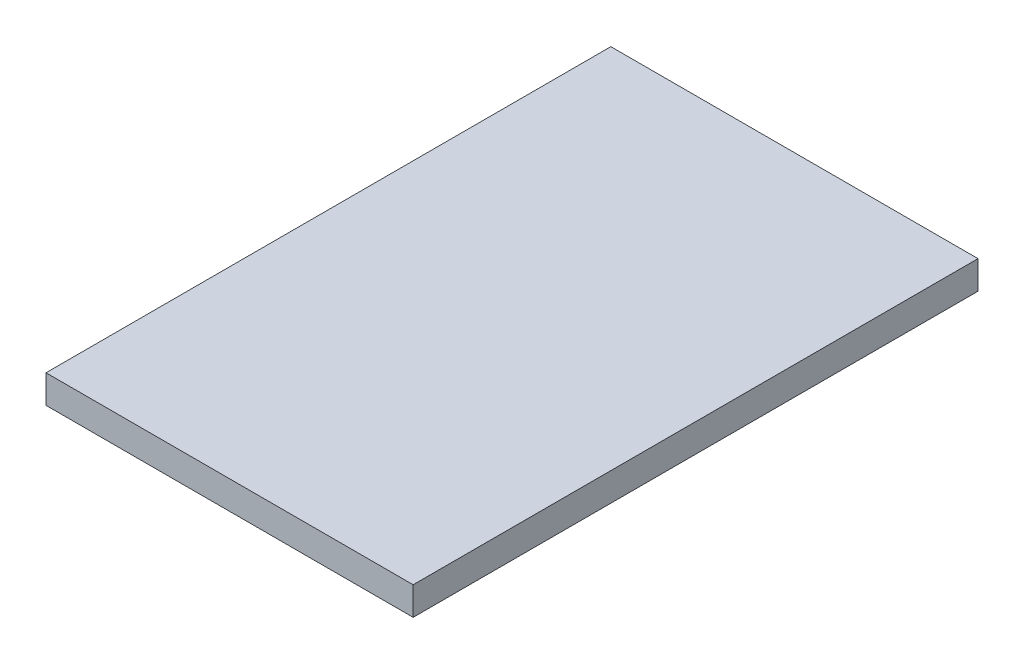
ISO-10303-21;
HEADER;
FILE_DESCRIPTION(('STEP AP214'),'2;1');
FILE_NAME('part.step','',(''),(''),'','','');
FILE_SCHEMA(('AUTOMOTIVE_DESIGN { 1 0 10303 214 1 1 1 1 }'));
ENDSEC;
DATA;
#1=APPLICATION_CONTEXT('core data for automotive mechanical design processes');
#2=APPLICATION_PROTOCOL_DEFINITION('international standard','automotive_design',2000,#1);
#3=PRODUCT_CONTEXT('',#1,'mechanical');
#4=PRODUCT('Part','Part','',(#3));
#5=PRODUCT_RELATED_PRODUCT_CATEGORY('part','',(#4));
#6=PRODUCT_DEFINITION_FORMATION('','',#4);
#7=PRODUCT_DEFINITION_CONTEXT('part definition',#1,'design');
#8=PRODUCT_DEFINITION('design','',#6,#7);
#9=PRODUCT_DEFINITION_SHAPE('','',#8);
#10=(LENGTH_UNIT() NAMED_UNIT(*) SI_UNIT(.MILLI.,.METRE.));
#11=(NAMED_UNIT(*) PLANE_ANGLE_UNIT() SI_UNIT($,.RADIAN.));
#12=(NAMED_UNIT(*) SI_UNIT($,.STERADIAN.) SOLID_ANGLE_UNIT());
#13=UNCERTAINTY_MEASURE_WITH_UNIT(LENGTH_MEASURE(1.E-05),#10,'distance_accuracy_value','');
#14=(GEOMETRIC_REPRESENTATION_CONTEXT(3) GLOBAL_UNCERTAINTY_ASSIGNED_CONTEXT((#13)) GLOBAL_UNIT_ASSIGNED_CONTEXT((#10,
#11,#12)) REPRESENTATION_CONTEXT('',''));
#15=CARTESIAN_POINT('',(0.,0.,0.));
#16=DIRECTION('',(0.,0.,1.));
#17=DIRECTION('',(1.,0.,0.));
#18=AXIS2_PLACEMENT_3D('',#15,#16,#17);
#19=CARTESIAN_POINT('',(-106.568983369222,25.4,-229.704347826087));
#20=DIRECTION('',(1.,0.,0.));
#21=DIRECTION('',(0.,0.,-1.));
#22=AXIS2_PLACEMENT_3D('',#19,#20,#21);
#23=PLANE('',#22);
#24=DIRECTION('',(0.,0.,1.));
#25=VECTOR('',#24,1.);
#26=CARTESIAN_POINT('',(-106.568983369222,0.,-229.704347826087));
#27=LINE('',#26,#25);
#28=CARTESIAN_POINT('',(-106.568983369222,0.,-229.704347826087));
#29=VERTEX_POINT('',#28);
#30=CARTESIAN_POINT('',(-106.568983369222,0.,278.295652173913));
#31=VERTEX_POINT('',#30);
#32=EDGE_CURVE('E102',#29,#31,#27,.T.);
#33=ORIENTED_EDGE('',*,*,#32,.T.);
#34=DIRECTION('',(0.,-1.,0.));
#35=VECTOR('',#34,1.);
#36=CARTESIAN_POINT('',(-106.568983369222,25.4,278.295652173913));
#37=LINE('',#36,#35);
#38=CARTESIAN_POINT('',(-106.568983369222,25.4,278.295652173913));
#39=VERTEX_POINT('',#38);
#40=EDGE_CURVE('E11',#39,#31,#37,.T.);
#41=ORIENTED_EDGE('',*,*,#40,.F.);
#42=DIRECTION('',(0.,0.,1.));
#43=VECTOR('',#42,1.);
#44=CARTESIAN_POINT('',(-106.568983369222,25.4,-229.704347826087));
#45=LINE('',#44,#43);
#46=CARTESIAN_POINT('',(-106.568983369222,25.4,-229.704347826087));
#47=VERTEX_POINT('',#46);
#48=EDGE_CURVE('E90',#47,#39,#45,.T.);
#49=ORIENTED_EDGE('',*,*,#48,.F.);
#50=DIRECTION('',(0.,-1.,0.));
#51=VECTOR('',#50,1.);
#52=CARTESIAN_POINT('',(-106.568983369222,25.4,-229.704347826087));
#53=LINE('',#52,#51);
#54=EDGE_CURVE('E98',#47,#29,#53,.T.);
#55=ORIENTED_EDGE('',*,*,#54,.T.);
#56=EDGE_LOOP('',(#33,#41,#49,#55));
#57=FACE_BOUND('',#56,.T.);
#58=ADVANCED_FACE('F39',(#57),#23,.F.);
#59=CARTESIAN_POINT('',(-106.568983369222,25.4,278.295652173913));
#60=DIRECTION('',(0.,0.,-1.));
#61=DIRECTION('',(-1.,0.,0.));
#62=AXIS2_PLACEMENT_3D('',#59,#60,#61);
#63=PLANE('',#62);
#64=DIRECTION('',(1.,0.,0.));
#65=VECTOR('',#64,1.);
#66=CARTESIAN_POINT('',(-106.568983369222,0.,278.295652173913));
#67=LINE('',#66,#65);
#68=CARTESIAN_POINT('',(223.631016630778,0.,278.295652173913));
#69=VERTEX_POINT('',#68);
#70=EDGE_CURVE('E94',#31,#69,#67,.T.);
#71=ORIENTED_EDGE('',*,*,#70,.T.);
#72=DIRECTION('',(0.,-1.,0.));
#73=VECTOR('',#72,1.);
#74=CARTESIAN_POINT('',(223.631016630778,25.4,278.295652173913));
#75=LINE('',#74,#73);
#76=CARTESIAN_POINT('',(223.631016630778,25.4,278.295652173913));
#77=VERTEX_POINT('',#76);
#78=EDGE_CURVE('E47',#77,#69,#75,.T.);
#79=ORIENTED_EDGE('',*,*,#78,.F.);
#80=DIRECTION('',(1.,0.,0.));
#81=VECTOR('',#80,1.);
#82=CARTESIAN_POINT('',(-106.568983369222,25.4,278.295652173913));
#83=LINE('',#82,#81);
#84=EDGE_CURVE('E85',#39,#77,#83,.T.);
#85=ORIENTED_EDGE('',*,*,#84,.F.);
#86=ORIENTED_EDGE('',*,*,#40,.T.);
#87=EDGE_LOOP('',(#71,#79,#85,#86));
#88=FACE_BOUND('',#87,.T.);
#89=ADVANCED_FACE('F93',(#88),#63,.F.);
#90=CARTESIAN_POINT('',(223.631016630778,25.4,-229.704347826087));
#91=DIRECTION('',(-1.,0.,0.));
#92=DIRECTION('',(0.,0.,1.));
#93=AXIS2_PLACEMENT_3D('',#90,#91,#92);
#94=PLANE('',#93);
#95=DIRECTION('',(0.,0.,-1.));
#96=VECTOR('',#95,1.);
#97=CARTESIAN_POINT('',(223.631016630778,0.,-229.704347826087));
#98=LINE('',#97,#96);
#99=CARTESIAN_POINT('',(223.631016630778,0.,-229.704347826087));
#100=VERTEX_POINT('',#99);
#101=EDGE_CURVE('E72',#69,#100,#98,.T.);
#102=ORIENTED_EDGE('',*,*,#101,.T.);
#103=DIRECTION('',(0.,-1.,0.));
#104=VECTOR('',#103,1.);
#105=CARTESIAN_POINT('',(223.631016630778,25.4,-229.704347826087));
#106=LINE('',#105,#104);
#107=CARTESIAN_POINT('',(223.631016630778,25.4,-229.704347826087));
#108=VERTEX_POINT('',#107);
#109=EDGE_CURVE('E95',#108,#100,#106,.T.);
#110=ORIENTED_EDGE('',*,*,#109,.F.);
#111=DIRECTION('',(0.,0.,-1.));
#112=VECTOR('',#111,1.);
#113=CARTESIAN_POINT('',(223.631016630778,25.4,-229.704347826087));
#114=LINE('',#113,#112);
#115=EDGE_CURVE('E88',#77,#108,#114,.T.);
#116=ORIENTED_EDGE('',*,*,#115,.F.);
#117=ORIENTED_EDGE('',*,*,#78,.T.);
#118=EDGE_LOOP('',(#102,#110,#116,#117));
#119=FACE_BOUND('',#118,.T.);
#120=ADVANCED_FACE('F96',(#119),#94,.F.);
#121=CARTESIAN_POINT('',(-106.568983369222,25.4,-229.704347826087));
#122=DIRECTION('',(0.,0.,1.));
#123=DIRECTION('',(1.,0.,0.));
#124=AXIS2_PLACEMENT_3D('',#121,#122,#123);
#125=PLANE('',#124);
#126=DIRECTION('',(-1.,0.,0.));
#127=VECTOR('',#126,1.);
#128=CARTESIAN_POINT('',(-106.568983369222,0.,-229.704347826087));
#129=LINE('',#128,#127);
#130=EDGE_CURVE('E78',#100,#29,#129,.T.);
#131=ORIENTED_EDGE('',*,*,#130,.T.);
#132=ORIENTED_EDGE('',*,*,#54,.F.);
#133=DIRECTION('',(-1.,0.,0.));
#134=VECTOR('',#133,1.);
#135=CARTESIAN_POINT('',(-106.568983369222,25.4,-229.704347826087));
#136=LINE('',#135,#134);
#137=EDGE_CURVE('E55',#108,#47,#136,.T.);
#138=ORIENTED_EDGE('',*,*,#137,.F.);
#139=ORIENTED_EDGE('',*,*,#109,.T.);
#140=EDGE_LOOP('',(#131,#132,#138,#139));
#141=FACE_BOUND('',#140,.T.);
#142=ADVANCED_FACE('F109',(#141),#125,.F.);
#143=CARTESIAN_POINT('',(0.,25.4,0.));
#144=DIRECTION('',(0.,1.,0.));
#145=DIRECTION('',(0.,0.,1.));
#146=AXIS2_PLACEMENT_3D('',#143,#144,#145);
#147=PLANE('',#146);
#148=ORIENTED_EDGE('',*,*,#48,.T.);
#149=ORIENTED_EDGE('',*,*,#84,.T.);
#150=ORIENTED_EDGE('',*,*,#115,.T.);
#151=ORIENTED_EDGE('',*,*,#137,.T.);
#152=EDGE_LOOP('',(#148,#149,#150,#151));
#153=FACE_BOUND('',#152,.T.);
#154=ADVANCED_FACE('F86',(#153),#147,.T.);
#155=CARTESIAN_POINT('',(0.,0.,0.));
#156=DIRECTION('',(0.,1.,0.));
#157=DIRECTION('',(0.,0.,1.));
#158=AXIS2_PLACEMENT_3D('',#155,#156,#157);
#159=PLANE('',#158);
#160=ORIENTED_EDGE('',*,*,#32,.F.);
#161=ORIENTED_EDGE('',*,*,#130,.F.);
#162=ORIENTED_EDGE('',*,*,#101,.F.);
#163=ORIENTED_EDGE('',*,*,#70,.F.);
#164=EDGE_LOOP('',(#160,#161,#162,#163));
#165=FACE_BOUND('',#164,.T.);
#166=ADVANCED_FACE('F112',(#165),#159,.F.);
#167=CLOSED_SHELL('',(#58,#89,#120,#142,#154,#166));
#168=MANIFOLD_SOLID_BREP('B2',#167);
#169=ADVANCED_BREP_SHAPE_REPRESENTATION('',(#18,#168),#14);
#170=SHAPE_DEFINITION_REPRESENTATION(#9,#169);
ENDSEC;
END-ISO-10303-21;
